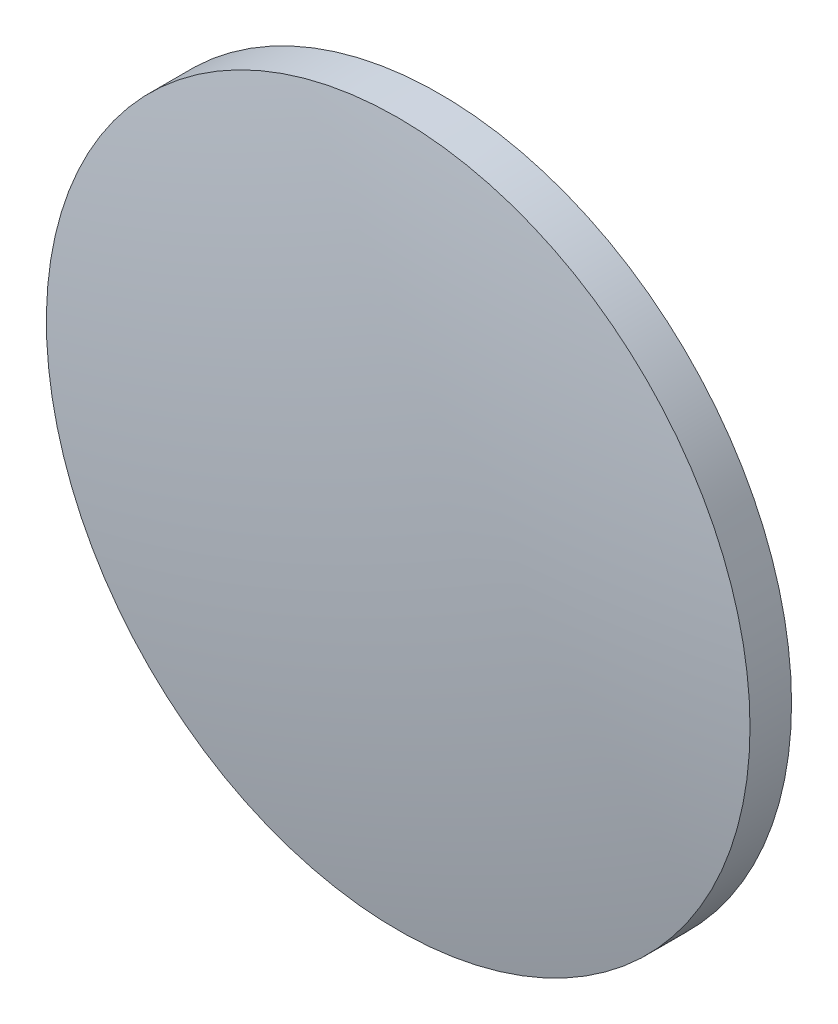
ISO-10303-21;
HEADER;
FILE_DESCRIPTION(('STEP AP214'),'2;1');
FILE_NAME('part.step','',(''),(''),'','','');
FILE_SCHEMA(('AUTOMOTIVE_DESIGN { 1 0 10303 214 1 1 1 1 }'));
ENDSEC;
DATA;
#1=APPLICATION_CONTEXT('core data for automotive mechanical design processes');
#2=APPLICATION_PROTOCOL_DEFINITION('international standard','automotive_design',2000,#1);
#3=PRODUCT_CONTEXT('',#1,'mechanical');
#4=PRODUCT('Part','Part','',(#3));
#5=PRODUCT_RELATED_PRODUCT_CATEGORY('part','',(#4));
#6=PRODUCT_DEFINITION_FORMATION('','',#4);
#7=PRODUCT_DEFINITION_CONTEXT('part definition',#1,'design');
#8=PRODUCT_DEFINITION('design','',#6,#7);
#9=PRODUCT_DEFINITION_SHAPE('','',#8);
#10=(LENGTH_UNIT() NAMED_UNIT(*) SI_UNIT(.MILLI.,.METRE.));
#11=(NAMED_UNIT(*) PLANE_ANGLE_UNIT() SI_UNIT($,.RADIAN.));
#12=(NAMED_UNIT(*) SI_UNIT($,.STERADIAN.) SOLID_ANGLE_UNIT());
#13=UNCERTAINTY_MEASURE_WITH_UNIT(LENGTH_MEASURE(1.E-05),#10,'distance_accuracy_value','');
#14=(GEOMETRIC_REPRESENTATION_CONTEXT(3) GLOBAL_UNCERTAINTY_ASSIGNED_CONTEXT((#13)) GLOBAL_UNIT_ASSIGNED_CONTEXT((#10,
#11,#12)) REPRESENTATION_CONTEXT('',''));
#15=CARTESIAN_POINT('',(0.,0.,0.));
#16=DIRECTION('',(0.,0.,1.));
#17=DIRECTION('',(1.,0.,0.));
#18=AXIS2_PLACEMENT_3D('',#15,#16,#17);
#19=CARTESIAN_POINT('',(0.,0.,-151.97));
#20=DIRECTION('',(0.,0.,1.));
#21=DIRECTION('',(0.,1.,0.));
#22=AXIS2_PLACEMENT_3D('',#19,#20,#21);
#23=SPHERICAL_SURFACE('',#22,154.52);
#24=CARTESIAN_POINT('',(0.,0.,0.448077667972175));
#25=DIRECTION('',(0.,0.,1.));
#26=DIRECTION('',(1.,0.,0.));
#27=AXIS2_PLACEMENT_3D('',#24,#25,#26);
#28=CIRCLE('',#27,25.4);
#29=CARTESIAN_POINT('',(25.4,0.,0.448077667972175));
#30=VERTEX_POINT('',#29);
#31=EDGE_CURVE('E8',#30,#30,#28,.T.);
#32=ORIENTED_EDGE('',*,*,#31,.T.);
#33=EDGE_LOOP('',(#32));
#34=FACE_BOUND('',#33,.T.);
#35=ADVANCED_FACE('F12',(#34),#23,.T.);
#36=CARTESIAN_POINT('',(0.,0.,4.30813204540037));
#37=DIRECTION('',(0.,0.,1.));
#38=DIRECTION('',(1.,0.,0.));
#39=AXIS2_PLACEMENT_3D('',#36,#37,#38);
#40=CYLINDRICAL_SURFACE('',#39,25.4);
#41=ORIENTED_EDGE('',*,*,#31,.F.);
#42=EDGE_LOOP('',(#41));
#43=FACE_BOUND('',#42,.T.);
#44=CARTESIAN_POINT('',(0.,0.,-2.55));
#45=DIRECTION('',(0.,0.,1.));
#46=DIRECTION('',(1.,0.,0.));
#47=AXIS2_PLACEMENT_3D('',#44,#45,#46);
#48=CIRCLE('',#47,25.4);
#49=CARTESIAN_POINT('',(25.4,0.,-2.55));
#50=VERTEX_POINT('',#49);
#51=EDGE_CURVE('E18',#50,#50,#48,.T.);
#52=ORIENTED_EDGE('',*,*,#51,.T.);
#53=EDGE_LOOP('',(#52));
#54=FACE_BOUND('',#53,.T.);
#55=ADVANCED_FACE('F24',(#43,#54),#40,.T.);
#56=CARTESIAN_POINT('',(0.,0.,-2.55));
#57=DIRECTION('',(0.,0.,1.));
#58=DIRECTION('',(1.,0.,0.));
#59=AXIS2_PLACEMENT_3D('',#56,#57,#58);
#60=PLANE('',#59);
#61=ORIENTED_EDGE('',*,*,#51,.F.);
#62=EDGE_LOOP('',(#61));
#63=FACE_BOUND('',#62,.T.);
#64=ADVANCED_FACE('F26',(#63),#60,.F.);
#65=CLOSED_SHELL('',(#35,#55,#64));
#66=MANIFOLD_SOLID_BREP('B1',#65);
#67=ADVANCED_BREP_SHAPE_REPRESENTATION('',(#18,#66),#14);
#68=SHAPE_DEFINITION_REPRESENTATION(#9,#67);
ENDSEC;
END-ISO-10303-21;
